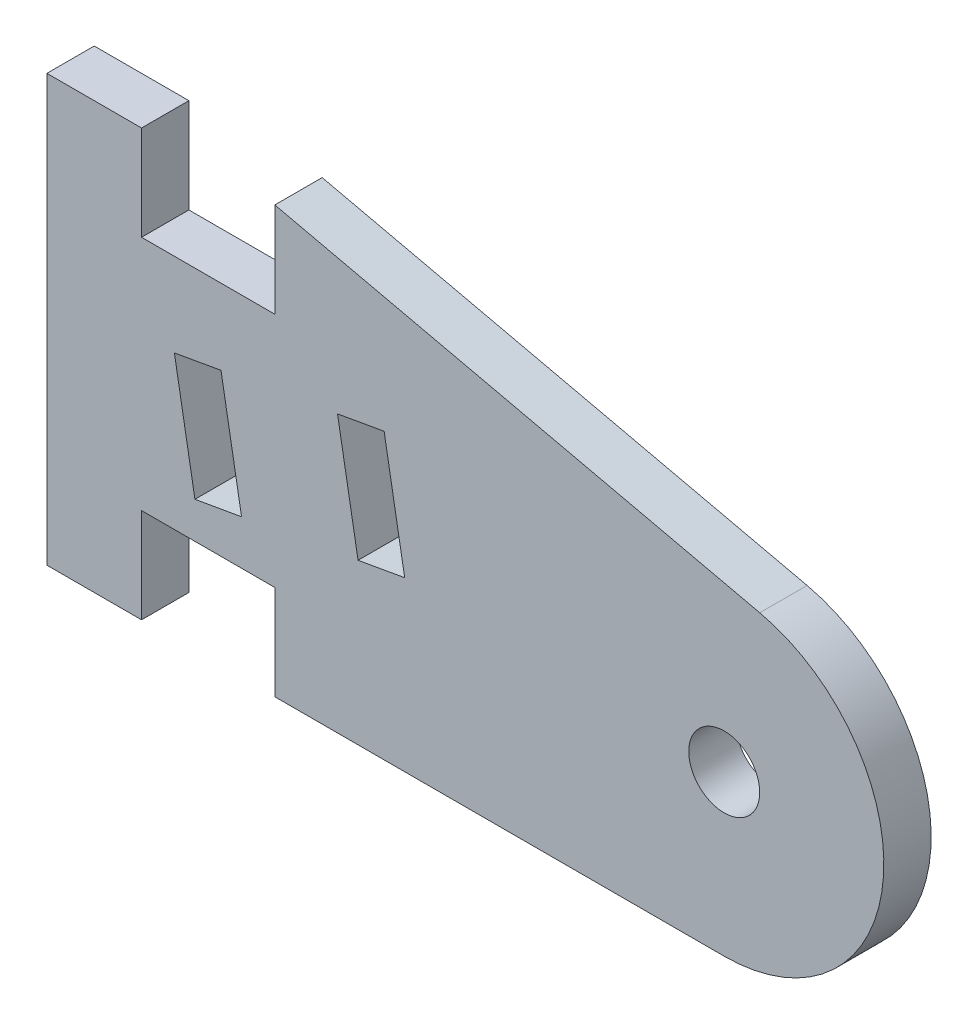
ISO-10303-21;
HEADER;
FILE_DESCRIPTION(('STEP AP214'),'2;1');
FILE_NAME('part.step','',(''),(''),'','','');
FILE_SCHEMA(('AUTOMOTIVE_DESIGN { 1 0 10303 214 1 1 1 1 }'));
ENDSEC;
DATA;
#1=APPLICATION_CONTEXT('core data for automotive mechanical design processes');
#2=APPLICATION_PROTOCOL_DEFINITION('international standard','automotive_design',2000,#1);
#3=PRODUCT_CONTEXT('',#1,'mechanical');
#4=PRODUCT('Part','Part','',(#3));
#5=PRODUCT_RELATED_PRODUCT_CATEGORY('part','',(#4));
#6=PRODUCT_DEFINITION_FORMATION('','',#4);
#7=PRODUCT_DEFINITION_CONTEXT('part definition',#1,'design');
#8=PRODUCT_DEFINITION('design','',#6,#7);
#9=PRODUCT_DEFINITION_SHAPE('','',#8);
#10=(LENGTH_UNIT() NAMED_UNIT(*) SI_UNIT(.MILLI.,.METRE.));
#11=(NAMED_UNIT(*) PLANE_ANGLE_UNIT() SI_UNIT($,.RADIAN.));
#12=(NAMED_UNIT(*) SI_UNIT($,.STERADIAN.) SOLID_ANGLE_UNIT());
#13=UNCERTAINTY_MEASURE_WITH_UNIT(LENGTH_MEASURE(1.E-05),#10,'distance_accuracy_value','');
#14=(GEOMETRIC_REPRESENTATION_CONTEXT(3) GLOBAL_UNCERTAINTY_ASSIGNED_CONTEXT((#13)) GLOBAL_UNIT_ASSIGNED_CONTEXT((#10,
#11,#12)) REPRESENTATION_CONTEXT('',''));
#15=CARTESIAN_POINT('',(0.,0.,0.));
#16=DIRECTION('',(0.,0.,1.));
#17=DIRECTION('',(1.,0.,0.));
#18=AXIS2_PLACEMENT_3D('',#15,#16,#17);
#19=CARTESIAN_POINT('',(28.6215163494173,6.74504414299814,2.));
#20=DIRECTION('',(0.,0.,1.));
#21=DIRECTION('',(1.,0.,0.));
#22=AXIS2_PLACEMENT_3D('',#19,#20,#21);
#23=PLANE('',#22);
#24=DIRECTION('',(-0.984807753012208,-0.173648177666932,0.));
#25=VECTOR('',#24,1.);
#26=CARTESIAN_POINT('',(14.2504500193325,12.02557168038,2.));
#27=LINE('',#26,#25);
#28=CARTESIAN_POINT('',(14.2504500193325,12.02557168038,2.));
#29=VERTEX_POINT('',#28);
#30=CARTESIAN_POINT('',(12.280834513308,11.6782753250461,2.));
#31=VERTEX_POINT('',#30);
#32=EDGE_CURVE('E178',#29,#31,#27,.T.);
#33=ORIENTED_EDGE('',*,*,#32,.F.);
#34=DIRECTION('',(-0.173648177666932,0.984807753012208,0.));
#35=VECTOR('',#34,1.);
#36=CARTESIAN_POINT('',(14.2504500193325,12.02557168038,2.));
#37=LINE('',#36,#35);
#38=CARTESIAN_POINT('',(15.1186909076671,7.10153291531894,2.));
#39=VERTEX_POINT('',#38);
#40=EDGE_CURVE('E170',#39,#29,#37,.T.);
#41=ORIENTED_EDGE('',*,*,#40,.F.);
#42=DIRECTION('',(0.984807753012208,0.173648177666931,0.));
#43=VECTOR('',#42,1.);
#44=CARTESIAN_POINT('',(13.1490754016427,6.75423655998508,2.));
#45=LINE('',#44,#43);
#46=CARTESIAN_POINT('',(13.1490754016427,6.75423655998508,2.));
#47=VERTEX_POINT('',#46);
#48=EDGE_CURVE('E193',#47,#39,#45,.T.);
#49=ORIENTED_EDGE('',*,*,#48,.F.);
#50=DIRECTION('',(0.173648177666932,-0.984807753012208,0.));
#51=VECTOR('',#50,1.);
#52=CARTESIAN_POINT('',(12.280834513308,11.6782753250461,2.));
#53=LINE('',#52,#51);
#54=EDGE_CURVE('E191',#31,#47,#53,.T.);
#55=ORIENTED_EDGE('',*,*,#54,.F.);
#56=EDGE_LOOP('',(#33,#41,#49,#55));
#57=FACE_BOUND('',#56,.T.);
#58=DIRECTION('',(0.,-1.,0.));
#59=VECTOR('',#58,1.);
#60=CARTESIAN_POINT('',(9.63151634941732,18.0003410835651,2.));
#61=LINE('',#60,#59);
#62=CARTESIAN_POINT('',(9.63151634941732,18.0003410835651,2.));
#63=VERTEX_POINT('',#62);
#64=CARTESIAN_POINT('',(9.63151634941733,14.0003410835651,2.));
#65=VERTEX_POINT('',#64);
#66=EDGE_CURVE('E240',#63,#65,#61,.T.);
#67=ORIENTED_EDGE('',*,*,#66,.T.);
#68=DIRECTION('',(-1.,0.,0.));
#69=VECTOR('',#68,1.);
#70=CARTESIAN_POINT('',(9.63151634941733,14.0003410835651,2.));
#71=LINE('',#70,#69);
#72=CARTESIAN_POINT('',(4.,14.0003410835651,2.));
#73=VERTEX_POINT('',#72);
#74=EDGE_CURVE('E243',#65,#73,#71,.T.);
#75=ORIENTED_EDGE('',*,*,#74,.T.);
#76=DIRECTION('',(0.,1.,0.));
#77=VECTOR('',#76,1.);
#78=CARTESIAN_POINT('',(4.,18.0003410835651,2.));
#79=LINE('',#78,#77);
#80=CARTESIAN_POINT('',(4.,18.0003410835651,2.));
#81=VERTEX_POINT('',#80);
#82=EDGE_CURVE('E246',#73,#81,#79,.T.);
#83=ORIENTED_EDGE('',*,*,#82,.T.);
#84=DIRECTION('',(-1.,0.,0.));
#85=VECTOR('',#84,1.);
#86=CARTESIAN_POINT('',(0.,18.0003410835651,2.));
#87=LINE('',#86,#85);
#88=CARTESIAN_POINT('',(0.,18.0003410835651,2.));
#89=VERTEX_POINT('',#88);
#90=EDGE_CURVE('E248',#81,#89,#87,.T.);
#91=ORIENTED_EDGE('',*,*,#90,.T.);
#92=DIRECTION('',(0.,-1.,0.));
#93=VECTOR('',#92,1.);
#94=CARTESIAN_POINT('',(0.,0.,2.));
#95=LINE('',#94,#93);
#96=CARTESIAN_POINT('',(0.,0.,2.));
#97=VERTEX_POINT('',#96);
#98=EDGE_CURVE('E250',#89,#97,#95,.T.);
#99=ORIENTED_EDGE('',*,*,#98,.T.);
#100=DIRECTION('',(1.,0.,0.));
#101=VECTOR('',#100,1.);
#102=CARTESIAN_POINT('',(0.,0.,2.));
#103=LINE('',#102,#101);
#104=CARTESIAN_POINT('',(4.,0.,2.));
#105=VERTEX_POINT('',#104);
#106=EDGE_CURVE('E252',#97,#105,#103,.T.);
#107=ORIENTED_EDGE('',*,*,#106,.T.);
#108=DIRECTION('',(0.,1.,0.));
#109=VECTOR('',#108,1.);
#110=CARTESIAN_POINT('',(4.,0.,2.));
#111=LINE('',#110,#109);
#112=CARTESIAN_POINT('',(4.,4.,2.));
#113=VERTEX_POINT('',#112);
#114=EDGE_CURVE('E254',#105,#113,#111,.T.);
#115=ORIENTED_EDGE('',*,*,#114,.T.);
#116=DIRECTION('',(1.,0.,0.));
#117=VECTOR('',#116,1.);
#118=CARTESIAN_POINT('',(9.63151634941733,4.,2.));
#119=LINE('',#118,#117);
#120=CARTESIAN_POINT('',(9.63151634941733,4.,2.));
#121=VERTEX_POINT('',#120);
#122=EDGE_CURVE('E256',#113,#121,#119,.T.);
#123=ORIENTED_EDGE('',*,*,#122,.T.);
#124=DIRECTION('',(0.,-1.,0.));
#125=VECTOR('',#124,1.);
#126=CARTESIAN_POINT('',(9.63151634941733,0.,2.));
#127=LINE('',#126,#125);
#128=CARTESIAN_POINT('',(9.63151634941733,0.,2.));
#129=VERTEX_POINT('',#128);
#130=EDGE_CURVE('E258',#121,#129,#127,.T.);
#131=ORIENTED_EDGE('',*,*,#130,.T.);
#132=DIRECTION('',(1.,0.,0.));
#133=VECTOR('',#132,1.);
#134=CARTESIAN_POINT('',(9.63151634941733,0.,2.));
#135=LINE('',#134,#133);
#136=CARTESIAN_POINT('',(28.6215163494173,0.,2.));
#137=VERTEX_POINT('',#136);
#138=EDGE_CURVE('E260',#129,#137,#135,.T.);
#139=ORIENTED_EDGE('',*,*,#138,.T.);
#140=CARTESIAN_POINT('',(28.6215163494173,6.74504414299814,2.));
#141=DIRECTION('',(0.,0.,1.));
#142=DIRECTION('',(1.,0.,0.));
#143=AXIS2_PLACEMENT_3D('',#140,#141,#142);
#144=CIRCLE('',#143,6.74504414299814);
#145=CARTESIAN_POINT('',(30.1231764912827,13.3208054912624,2.));
#146=VERTEX_POINT('',#145);
#147=EDGE_CURVE('E262',#137,#146,#144,.T.);
#148=ORIENTED_EDGE('',*,*,#147,.T.);
#149=DIRECTION('',(-0.974902640939778,0.222631625535649,0.));
#150=VECTOR('',#149,1.);
#151=CARTESIAN_POINT('',(9.63151634941732,18.0003410835651,2.));
#152=LINE('',#151,#150);
#153=EDGE_CURVE('E264',#146,#63,#152,.T.);
#154=ORIENTED_EDGE('',*,*,#153,.T.);
#155=EDGE_LOOP('',(#67,#75,#83,#91,#99,#107,#115,#123,#131,#139,#148,#154));
#156=FACE_BOUND('',#155,.T.);
#157=DIRECTION('',(0.173648177666931,-0.984807753012208,0.));
#158=VECTOR('',#157,1.);
#159=CARTESIAN_POINT('',(5.38718024222247,10.4627380813776,2.));
#160=LINE('',#159,#158);
#161=CARTESIAN_POINT('',(5.38718024222247,10.4627380813776,2.));
#162=VERTEX_POINT('',#161);
#163=CARTESIAN_POINT('',(6.25542113055713,5.53869931631654,2.));
#164=VERTEX_POINT('',#163);
#165=EDGE_CURVE('E211',#162,#164,#160,.T.);
#166=ORIENTED_EDGE('',*,*,#165,.F.);
#167=DIRECTION('',(-0.984807753012208,-0.173648177666931,0.));
#168=VECTOR('',#167,1.);
#169=CARTESIAN_POINT('',(7.35679574824689,10.8100344367115,2.));
#170=LINE('',#169,#168);
#171=CARTESIAN_POINT('',(7.35679574824689,10.8100344367115,2.));
#172=VERTEX_POINT('',#171);
#173=EDGE_CURVE('E209',#172,#162,#170,.T.);
#174=ORIENTED_EDGE('',*,*,#173,.F.);
#175=DIRECTION('',(-0.173648177666931,0.984807753012208,0.));
#176=VECTOR('',#175,1.);
#177=CARTESIAN_POINT('',(7.35679574824689,10.8100344367115,2.));
#178=LINE('',#177,#176);
#179=CARTESIAN_POINT('',(8.22503663658155,5.88599567165041,2.));
#180=VERTEX_POINT('',#179);
#181=EDGE_CURVE('E217',#180,#172,#178,.T.);
#182=ORIENTED_EDGE('',*,*,#181,.F.);
#183=DIRECTION('',(0.984807753012208,0.173648177666932,0.));
#184=VECTOR('',#183,1.);
#185=CARTESIAN_POINT('',(6.25542113055713,5.53869931631654,2.));
#186=LINE('',#185,#184);
#187=EDGE_CURVE('E214',#164,#180,#186,.T.);
#188=ORIENTED_EDGE('',*,*,#187,.F.);
#189=EDGE_LOOP('',(#166,#174,#182,#188));
#190=FACE_BOUND('',#189,.T.);
#191=CARTESIAN_POINT('',(28.6215163494173,6.74504414299814,2.));
#192=DIRECTION('',(0.,0.,1.));
#193=DIRECTION('',(1.,0.,0.));
#194=AXIS2_PLACEMENT_3D('',#191,#192,#193);
#195=CIRCLE('',#194,1.49999999999871);
#196=CARTESIAN_POINT('',(30.121516349416,6.74504414299814,2.));
#197=VERTEX_POINT('',#196);
#198=EDGE_CURVE('E199',#197,#197,#195,.T.);
#199=ORIENTED_EDGE('',*,*,#198,.F.);
#200=EDGE_LOOP('',(#199));
#201=FACE_BOUND('',#200,.T.);
#202=ADVANCED_FACE('F33',(#57,#156,#190,#201),#23,.T.);
#203=CARTESIAN_POINT('',(28.6215163494173,6.74504414299814,0.));
#204=DIRECTION('',(0.,0.,1.));
#205=DIRECTION('',(1.,0.,0.));
#206=AXIS2_PLACEMENT_3D('',#203,#204,#205);
#207=PLANE('',#206);
#208=DIRECTION('',(-0.173648177666932,0.984807753012208,0.));
#209=VECTOR('',#208,1.);
#210=CARTESIAN_POINT('',(14.2504500193325,12.02557168038,0.));
#211=LINE('',#210,#209);
#212=CARTESIAN_POINT('',(15.1186909076671,7.10153291531894,0.));
#213=VERTEX_POINT('',#212);
#214=CARTESIAN_POINT('',(14.2504500193325,12.02557168038,0.));
#215=VERTEX_POINT('',#214);
#216=EDGE_CURVE('E56',#213,#215,#211,.T.);
#217=ORIENTED_EDGE('',*,*,#216,.T.);
#218=DIRECTION('',(-0.984807753012208,-0.173648177666932,0.));
#219=VECTOR('',#218,1.);
#220=CARTESIAN_POINT('',(14.2504500193325,12.02557168038,0.));
#221=LINE('',#220,#219);
#222=CARTESIAN_POINT('',(12.280834513308,11.6782753250461,0.));
#223=VERTEX_POINT('',#222);
#224=EDGE_CURVE('E185',#215,#223,#221,.T.);
#225=ORIENTED_EDGE('',*,*,#224,.T.);
#226=DIRECTION('',(0.173648177666932,-0.984807753012208,0.));
#227=VECTOR('',#226,1.);
#228=CARTESIAN_POINT('',(12.280834513308,11.6782753250461,0.));
#229=LINE('',#228,#227);
#230=CARTESIAN_POINT('',(13.1490754016427,6.75423655998508,0.));
#231=VERTEX_POINT('',#230);
#232=EDGE_CURVE('E201',#223,#231,#229,.T.);
#233=ORIENTED_EDGE('',*,*,#232,.T.);
#234=DIRECTION('',(0.984807753012208,0.173648177666931,0.));
#235=VECTOR('',#234,1.);
#236=CARTESIAN_POINT('',(13.1490754016427,6.75423655998508,0.));
#237=LINE('',#236,#235);
#238=EDGE_CURVE('E179',#231,#213,#237,.T.);
#239=ORIENTED_EDGE('',*,*,#238,.T.);
#240=EDGE_LOOP('',(#217,#225,#233,#239));
#241=FACE_BOUND('',#240,.T.);
#242=DIRECTION('',(0.,-1.,0.));
#243=VECTOR('',#242,1.);
#244=CARTESIAN_POINT('',(9.63151634941732,18.0003410835651,0.));
#245=LINE('',#244,#243);
#246=CARTESIAN_POINT('',(9.63151634941732,18.0003410835651,0.));
#247=VERTEX_POINT('',#246);
#248=CARTESIAN_POINT('',(9.63151634941733,14.0003410835651,0.));
#249=VERTEX_POINT('',#248);
#250=EDGE_CURVE('E239',#247,#249,#245,.T.);
#251=ORIENTED_EDGE('',*,*,#250,.F.);
#252=DIRECTION('',(-0.974902640939778,0.222631625535649,0.));
#253=VECTOR('',#252,1.);
#254=CARTESIAN_POINT('',(9.63151634941732,18.0003410835651,0.));
#255=LINE('',#254,#253);
#256=CARTESIAN_POINT('',(30.1231764912827,13.3208054912624,0.));
#257=VERTEX_POINT('',#256);
#258=EDGE_CURVE('E244',#257,#247,#255,.T.);
#259=ORIENTED_EDGE('',*,*,#258,.F.);
#260=CARTESIAN_POINT('',(28.6215163494173,6.74504414299814,0.));
#261=DIRECTION('',(0.,0.,1.));
#262=DIRECTION('',(1.,0.,0.));
#263=AXIS2_PLACEMENT_3D('',#260,#261,#262);
#264=CIRCLE('',#263,6.74504414299814);
#265=CARTESIAN_POINT('',(28.6215163494173,0.,0.));
#266=VERTEX_POINT('',#265);
#267=EDGE_CURVE('E287',#266,#257,#264,.T.);
#268=ORIENTED_EDGE('',*,*,#267,.F.);
#269=DIRECTION('',(1.,0.,0.));
#270=VECTOR('',#269,1.);
#271=CARTESIAN_POINT('',(9.63151634941733,0.,0.));
#272=LINE('',#271,#270);
#273=CARTESIAN_POINT('',(9.63151634941733,0.,0.));
#274=VERTEX_POINT('',#273);
#275=EDGE_CURVE('E285',#274,#266,#272,.T.);
#276=ORIENTED_EDGE('',*,*,#275,.F.);
#277=DIRECTION('',(0.,-1.,0.));
#278=VECTOR('',#277,1.);
#279=CARTESIAN_POINT('',(9.63151634941733,0.,0.));
#280=LINE('',#279,#278);
#281=CARTESIAN_POINT('',(9.63151634941733,4.,0.));
#282=VERTEX_POINT('',#281);
#283=EDGE_CURVE('E283',#282,#274,#280,.T.);
#284=ORIENTED_EDGE('',*,*,#283,.F.);
#285=DIRECTION('',(1.,0.,0.));
#286=VECTOR('',#285,1.);
#287=CARTESIAN_POINT('',(9.63151634941733,4.,0.));
#288=LINE('',#287,#286);
#289=CARTESIAN_POINT('',(4.,4.,0.));
#290=VERTEX_POINT('',#289);
#291=EDGE_CURVE('E281',#290,#282,#288,.T.);
#292=ORIENTED_EDGE('',*,*,#291,.F.);
#293=DIRECTION('',(0.,1.,0.));
#294=VECTOR('',#293,1.);
#295=CARTESIAN_POINT('',(4.,0.,0.));
#296=LINE('',#295,#294);
#297=CARTESIAN_POINT('',(4.,0.,0.));
#298=VERTEX_POINT('',#297);
#299=EDGE_CURVE('E279',#298,#290,#296,.T.);
#300=ORIENTED_EDGE('',*,*,#299,.F.);
#301=DIRECTION('',(1.,0.,0.));
#302=VECTOR('',#301,1.);
#303=CARTESIAN_POINT('',(0.,0.,0.));
#304=LINE('',#303,#302);
#305=CARTESIAN_POINT('',(0.,0.,0.));
#306=VERTEX_POINT('',#305);
#307=EDGE_CURVE('E277',#306,#298,#304,.T.);
#308=ORIENTED_EDGE('',*,*,#307,.F.);
#309=DIRECTION('',(0.,-1.,0.));
#310=VECTOR('',#309,1.);
#311=CARTESIAN_POINT('',(0.,0.,0.));
#312=LINE('',#311,#310);
#313=CARTESIAN_POINT('',(0.,18.0003410835651,0.));
#314=VERTEX_POINT('',#313);
#315=EDGE_CURVE('E275',#314,#306,#312,.T.);
#316=ORIENTED_EDGE('',*,*,#315,.F.);
#317=DIRECTION('',(-1.,0.,0.));
#318=VECTOR('',#317,1.);
#319=CARTESIAN_POINT('',(0.,18.0003410835651,0.));
#320=LINE('',#319,#318);
#321=CARTESIAN_POINT('',(4.,18.0003410835651,0.));
#322=VERTEX_POINT('',#321);
#323=EDGE_CURVE('E273',#322,#314,#320,.T.);
#324=ORIENTED_EDGE('',*,*,#323,.F.);
#325=DIRECTION('',(0.,1.,0.));
#326=VECTOR('',#325,1.);
#327=CARTESIAN_POINT('',(4.,18.0003410835651,0.));
#328=LINE('',#327,#326);
#329=CARTESIAN_POINT('',(4.,14.0003410835651,0.));
#330=VERTEX_POINT('',#329);
#331=EDGE_CURVE('E271',#330,#322,#328,.T.);
#332=ORIENTED_EDGE('',*,*,#331,.F.);
#333=DIRECTION('',(-1.,0.,0.));
#334=VECTOR('',#333,1.);
#335=CARTESIAN_POINT('',(9.63151634941733,14.0003410835651,0.));
#336=LINE('',#335,#334);
#337=EDGE_CURVE('E269',#249,#330,#336,.T.);
#338=ORIENTED_EDGE('',*,*,#337,.F.);
#339=EDGE_LOOP('',(#251,#259,#268,#276,#284,#292,#300,#308,#316,#324,#332,#338));
#340=FACE_BOUND('',#339,.T.);
#341=DIRECTION('',(-0.984807753012208,-0.173648177666931,0.));
#342=VECTOR('',#341,1.);
#343=CARTESIAN_POINT('',(7.35679574824689,10.8100344367115,0.));
#344=LINE('',#343,#342);
#345=CARTESIAN_POINT('',(7.35679574824689,10.8100344367115,0.));
#346=VERTEX_POINT('',#345);
#347=CARTESIAN_POINT('',(5.38718024222247,10.4627380813776,0.));
#348=VERTEX_POINT('',#347);
#349=EDGE_CURVE('E186',#346,#348,#344,.T.);
#350=ORIENTED_EDGE('',*,*,#349,.T.);
#351=DIRECTION('',(0.173648177666931,-0.984807753012208,0.));
#352=VECTOR('',#351,1.);
#353=CARTESIAN_POINT('',(5.38718024222247,10.4627380813776,0.));
#354=LINE('',#353,#352);
#355=CARTESIAN_POINT('',(6.25542113055713,5.53869931631654,0.));
#356=VERTEX_POINT('',#355);
#357=EDGE_CURVE('E222',#348,#356,#354,.T.);
#358=ORIENTED_EDGE('',*,*,#357,.T.);
#359=DIRECTION('',(0.984807753012208,0.173648177666932,0.));
#360=VECTOR('',#359,1.);
#361=CARTESIAN_POINT('',(6.25542113055713,5.53869931631654,0.));
#362=LINE('',#361,#360);
#363=CARTESIAN_POINT('',(8.22503663658155,5.88599567165041,0.));
#364=VERTEX_POINT('',#363);
#365=EDGE_CURVE('E225',#356,#364,#362,.T.);
#366=ORIENTED_EDGE('',*,*,#365,.T.);
#367=DIRECTION('',(-0.173648177666931,0.984807753012208,0.));
#368=VECTOR('',#367,1.);
#369=CARTESIAN_POINT('',(7.35679574824689,10.8100344367115,0.));
#370=LINE('',#369,#368);
#371=EDGE_CURVE('E212',#364,#346,#370,.T.);
#372=ORIENTED_EDGE('',*,*,#371,.T.);
#373=EDGE_LOOP('',(#350,#358,#366,#372));
#374=FACE_BOUND('',#373,.T.);
#375=CARTESIAN_POINT('',(28.6215163494173,6.74504414299814,0.));
#376=DIRECTION('',(0.,0.,1.));
#377=DIRECTION('',(1.,0.,0.));
#378=AXIS2_PLACEMENT_3D('',#375,#376,#377);
#379=CIRCLE('',#378,1.49999999999871);
#380=CARTESIAN_POINT('',(30.121516349416,6.74504414299814,0.));
#381=VERTEX_POINT('',#380);
#382=EDGE_CURVE('E581',#381,#381,#379,.T.);
#383=ORIENTED_EDGE('',*,*,#382,.T.);
#384=EDGE_LOOP('',(#383));
#385=FACE_BOUND('',#384,.T.);
#386=ADVANCED_FACE('F329',(#241,#340,#374,#385),#207,.F.);
#387=CARTESIAN_POINT('',(9.63151634941732,18.0003410835651,2.));
#388=DIRECTION('',(1.,0.,0.));
#389=DIRECTION('',(0.,1.,0.));
#390=AXIS2_PLACEMENT_3D('',#387,#388,#389);
#391=PLANE('',#390);
#392=ORIENTED_EDGE('',*,*,#250,.T.);
#393=DIRECTION('',(0.,0.,-1.));
#394=VECTOR('',#393,1.);
#395=CARTESIAN_POINT('',(9.63151634941733,14.0003410835651,2.));
#396=LINE('',#395,#394);
#397=EDGE_CURVE('E11',#65,#249,#396,.T.);
#398=ORIENTED_EDGE('',*,*,#397,.F.);
#399=ORIENTED_EDGE('',*,*,#66,.F.);
#400=DIRECTION('',(0.,0.,-1.));
#401=VECTOR('',#400,1.);
#402=CARTESIAN_POINT('',(9.63151634941732,18.0003410835651,2.));
#403=LINE('',#402,#401);
#404=EDGE_CURVE('E266',#63,#247,#403,.T.);
#405=ORIENTED_EDGE('',*,*,#404,.T.);
#406=EDGE_LOOP('',(#392,#398,#399,#405));
#407=FACE_BOUND('',#406,.T.);
#408=ADVANCED_FACE('F35',(#407),#391,.F.);
#409=CARTESIAN_POINT('',(9.63151634941733,14.0003410835651,2.));
#410=DIRECTION('',(0.,-1.,0.));
#411=DIRECTION('',(1.,0.,0.));
#412=AXIS2_PLACEMENT_3D('',#409,#410,#411);
#413=PLANE('',#412);
#414=ORIENTED_EDGE('',*,*,#337,.T.);
#415=DIRECTION('',(0.,0.,-1.));
#416=VECTOR('',#415,1.);
#417=CARTESIAN_POINT('',(4.,14.0003410835651,2.));
#418=LINE('',#417,#416);
#419=EDGE_CURVE('E41',#73,#330,#418,.T.);
#420=ORIENTED_EDGE('',*,*,#419,.F.);
#421=ORIENTED_EDGE('',*,*,#74,.F.);
#422=ORIENTED_EDGE('',*,*,#397,.T.);
#423=EDGE_LOOP('',(#414,#420,#421,#422));
#424=FACE_BOUND('',#423,.T.);
#425=ADVANCED_FACE('F346',(#424),#413,.F.);
#426=CARTESIAN_POINT('',(4.,18.0003410835651,2.));
#427=DIRECTION('',(-1.,0.,0.));
#428=DIRECTION('',(0.,-1.,0.));
#429=AXIS2_PLACEMENT_3D('',#426,#427,#428);
#430=PLANE('',#429);
#431=ORIENTED_EDGE('',*,*,#331,.T.);
#432=DIRECTION('',(0.,0.,-1.));
#433=VECTOR('',#432,1.);
#434=CARTESIAN_POINT('',(4.,18.0003410835651,2.));
#435=LINE('',#434,#433);
#436=EDGE_CURVE('E316',#81,#322,#435,.T.);
#437=ORIENTED_EDGE('',*,*,#436,.F.);
#438=ORIENTED_EDGE('',*,*,#82,.F.);
#439=ORIENTED_EDGE('',*,*,#419,.T.);
#440=EDGE_LOOP('',(#431,#437,#438,#439));
#441=FACE_BOUND('',#440,.T.);
#442=ADVANCED_FACE('F323',(#441),#430,.F.);
#443=CARTESIAN_POINT('',(0.,18.0003410835651,2.));
#444=DIRECTION('',(0.,-1.,0.));
#445=DIRECTION('',(0.,0.,-1.));
#446=AXIS2_PLACEMENT_3D('',#443,#444,#445);
#447=PLANE('',#446);
#448=ORIENTED_EDGE('',*,*,#323,.T.);
#449=DIRECTION('',(0.,0.,-1.));
#450=VECTOR('',#449,1.);
#451=CARTESIAN_POINT('',(0.,18.0003410835651,2.));
#452=LINE('',#451,#450);
#453=EDGE_CURVE('E313',#89,#314,#452,.T.);
#454=ORIENTED_EDGE('',*,*,#453,.F.);
#455=ORIENTED_EDGE('',*,*,#90,.F.);
#456=ORIENTED_EDGE('',*,*,#436,.T.);
#457=EDGE_LOOP('',(#448,#454,#455,#456));
#458=FACE_BOUND('',#457,.T.);
#459=ADVANCED_FACE('F335',(#458),#447,.F.);
#460=CARTESIAN_POINT('',(0.,0.,2.));
#461=DIRECTION('',(1.,0.,0.));
#462=DIRECTION('',(0.,1.,0.));
#463=AXIS2_PLACEMENT_3D('',#460,#461,#462);
#464=PLANE('',#463);
#465=ORIENTED_EDGE('',*,*,#315,.T.);
#466=DIRECTION('',(0.,0.,-1.));
#467=VECTOR('',#466,1.);
#468=CARTESIAN_POINT('',(0.,0.,2.));
#469=LINE('',#468,#467);
#470=EDGE_CURVE('E310',#97,#306,#469,.T.);
#471=ORIENTED_EDGE('',*,*,#470,.F.);
#472=ORIENTED_EDGE('',*,*,#98,.F.);
#473=ORIENTED_EDGE('',*,*,#453,.T.);
#474=EDGE_LOOP('',(#465,#471,#472,#473));
#475=FACE_BOUND('',#474,.T.);
#476=ADVANCED_FACE('F339',(#475),#464,.F.);
#477=CARTESIAN_POINT('',(0.,0.,2.));
#478=DIRECTION('',(0.,1.,0.));
#479=DIRECTION('',(0.,0.,1.));
#480=AXIS2_PLACEMENT_3D('',#477,#478,#479);
#481=PLANE('',#480);
#482=ORIENTED_EDGE('',*,*,#307,.T.);
#483=DIRECTION('',(0.,0.,-1.));
#484=VECTOR('',#483,1.);
#485=CARTESIAN_POINT('',(4.,0.,2.));
#486=LINE('',#485,#484);
#487=EDGE_CURVE('E307',#105,#298,#486,.T.);
#488=ORIENTED_EDGE('',*,*,#487,.F.);
#489=ORIENTED_EDGE('',*,*,#106,.F.);
#490=ORIENTED_EDGE('',*,*,#470,.T.);
#491=EDGE_LOOP('',(#482,#488,#489,#490));
#492=FACE_BOUND('',#491,.T.);
#493=ADVANCED_FACE('F379',(#492),#481,.F.);
#494=CARTESIAN_POINT('',(4.,0.,2.));
#495=DIRECTION('',(-1.,0.,0.));
#496=DIRECTION('',(0.,0.,1.));
#497=AXIS2_PLACEMENT_3D('',#494,#495,#496);
#498=PLANE('',#497);
#499=ORIENTED_EDGE('',*,*,#299,.T.);
#500=DIRECTION('',(0.,0.,-1.));
#501=VECTOR('',#500,1.);
#502=CARTESIAN_POINT('',(4.,4.,2.));
#503=LINE('',#502,#501);
#504=EDGE_CURVE('E304',#113,#290,#503,.T.);
#505=ORIENTED_EDGE('',*,*,#504,.F.);
#506=ORIENTED_EDGE('',*,*,#114,.F.);
#507=ORIENTED_EDGE('',*,*,#487,.T.);
#508=EDGE_LOOP('',(#499,#505,#506,#507));
#509=FACE_BOUND('',#508,.T.);
#510=ADVANCED_FACE('F377',(#509),#498,.F.);
#511=CARTESIAN_POINT('',(9.63151634941733,4.,2.));
#512=DIRECTION('',(0.,1.,0.));
#513=DIRECTION('',(-1.,0.,0.));
#514=AXIS2_PLACEMENT_3D('',#511,#512,#513);
#515=PLANE('',#514);
#516=ORIENTED_EDGE('',*,*,#291,.T.);
#517=DIRECTION('',(0.,0.,-1.));
#518=VECTOR('',#517,1.);
#519=CARTESIAN_POINT('',(9.63151634941733,4.,2.));
#520=LINE('',#519,#518);
#521=EDGE_CURVE('E301',#121,#282,#520,.T.);
#522=ORIENTED_EDGE('',*,*,#521,.F.);
#523=ORIENTED_EDGE('',*,*,#122,.F.);
#524=ORIENTED_EDGE('',*,*,#504,.T.);
#525=EDGE_LOOP('',(#516,#522,#523,#524));
#526=FACE_BOUND('',#525,.T.);
#527=ADVANCED_FACE('F373',(#526),#515,.F.);
#528=CARTESIAN_POINT('',(9.63151634941733,0.,2.));
#529=DIRECTION('',(1.,0.,0.));
#530=DIRECTION('',(0.,0.,-1.));
#531=AXIS2_PLACEMENT_3D('',#528,#529,#530);
#532=PLANE('',#531);
#533=ORIENTED_EDGE('',*,*,#283,.T.);
#534=DIRECTION('',(0.,0.,-1.));
#535=VECTOR('',#534,1.);
#536=CARTESIAN_POINT('',(9.63151634941733,0.,2.));
#537=LINE('',#536,#535);
#538=EDGE_CURVE('E298',#129,#274,#537,.T.);
#539=ORIENTED_EDGE('',*,*,#538,.F.);
#540=ORIENTED_EDGE('',*,*,#130,.F.);
#541=ORIENTED_EDGE('',*,*,#521,.T.);
#542=EDGE_LOOP('',(#533,#539,#540,#541));
#543=FACE_BOUND('',#542,.T.);
#544=ADVANCED_FACE('F368',(#543),#532,.F.);
#545=CARTESIAN_POINT('',(9.63151634941733,0.,2.));
#546=DIRECTION('',(0.,1.,0.));
#547=DIRECTION('',(0.,0.,1.));
#548=AXIS2_PLACEMENT_3D('',#545,#546,#547);
#549=PLANE('',#548);
#550=ORIENTED_EDGE('',*,*,#275,.T.);
#551=DIRECTION('',(0.,0.,-1.));
#552=VECTOR('',#551,1.);
#553=CARTESIAN_POINT('',(28.6215163494173,0.,2.));
#554=LINE('',#553,#552);
#555=EDGE_CURVE('E295',#137,#266,#554,.T.);
#556=ORIENTED_EDGE('',*,*,#555,.F.);
#557=ORIENTED_EDGE('',*,*,#138,.F.);
#558=ORIENTED_EDGE('',*,*,#538,.T.);
#559=EDGE_LOOP('',(#550,#556,#557,#558));
#560=FACE_BOUND('',#559,.T.);
#561=ADVANCED_FACE('F362',(#560),#549,.F.);
#562=CARTESIAN_POINT('',(28.6215163494173,6.74504414299814,2.));
#563=DIRECTION('',(0.,0.,-1.));
#564=DIRECTION('',(-1.,0.,0.));
#565=AXIS2_PLACEMENT_3D('',#562,#563,#564);
#566=CYLINDRICAL_SURFACE('',#565,6.74504414299814);
#567=ORIENTED_EDGE('',*,*,#267,.T.);
#568=DIRECTION('',(0.,0.,-1.));
#569=VECTOR('',#568,1.);
#570=CARTESIAN_POINT('',(30.1231764912827,13.3208054912624,2.));
#571=LINE('',#570,#569);
#572=EDGE_CURVE('E292',#146,#257,#571,.T.);
#573=ORIENTED_EDGE('',*,*,#572,.F.);
#574=ORIENTED_EDGE('',*,*,#147,.F.);
#575=ORIENTED_EDGE('',*,*,#555,.T.);
#576=EDGE_LOOP('',(#567,#573,#574,#575));
#577=FACE_BOUND('',#576,.T.);
#578=ADVANCED_FACE('F358',(#577),#566,.T.);
#579=CARTESIAN_POINT('',(9.63151634941732,18.0003410835651,2.));
#580=DIRECTION('',(-0.222631625535649,-0.974902640939778,0.));
#581=DIRECTION('',(0.974902640939779,-0.222631625535649,0.));
#582=AXIS2_PLACEMENT_3D('',#579,#580,#581);
#583=PLANE('',#582);
#584=ORIENTED_EDGE('',*,*,#258,.T.);
#585=ORIENTED_EDGE('',*,*,#404,.F.);
#586=ORIENTED_EDGE('',*,*,#153,.F.);
#587=ORIENTED_EDGE('',*,*,#572,.T.);
#588=EDGE_LOOP('',(#584,#585,#586,#587));
#589=FACE_BOUND('',#588,.T.);
#590=ADVANCED_FACE('F353',(#589),#583,.F.);
#591=CARTESIAN_POINT('',(7.35679574824689,10.8100344367115,2.));
#592=DIRECTION('',(0.173648177666931,-0.984807753012208,0.));
#593=DIRECTION('',(0.984807753012208,0.173648177666931,0.));
#594=AXIS2_PLACEMENT_3D('',#591,#592,#593);
#595=PLANE('',#594);
#596=ORIENTED_EDGE('',*,*,#349,.F.);
#597=DIRECTION('',(0.,0.,-1.));
#598=VECTOR('',#597,1.);
#599=CARTESIAN_POINT('',(7.35679574824689,10.8100344367115,2.));
#600=LINE('',#599,#598);
#601=EDGE_CURVE('E219',#172,#346,#600,.T.);
#602=ORIENTED_EDGE('',*,*,#601,.F.);
#603=ORIENTED_EDGE('',*,*,#173,.T.);
#604=DIRECTION('',(0.,0.,-1.));
#605=VECTOR('',#604,1.);
#606=CARTESIAN_POINT('',(5.38718024222247,10.4627380813776,2.));
#607=LINE('',#606,#605);
#608=EDGE_CURVE('E236',#162,#348,#607,.T.);
#609=ORIENTED_EDGE('',*,*,#608,.T.);
#610=EDGE_LOOP('',(#596,#602,#603,#609));
#611=FACE_BOUND('',#610,.T.);
#612=ADVANCED_FACE('F396',(#611),#595,.T.);
#613=CARTESIAN_POINT('',(5.38718024222247,10.4627380813776,2.));
#614=DIRECTION('',(0.984807753012208,0.173648177666931,0.));
#615=DIRECTION('',(-0.173648177666931,0.984807753012208,0.));
#616=AXIS2_PLACEMENT_3D('',#613,#614,#615);
#617=PLANE('',#616);
#618=ORIENTED_EDGE('',*,*,#357,.F.);
#619=ORIENTED_EDGE('',*,*,#608,.F.);
#620=ORIENTED_EDGE('',*,*,#165,.T.);
#621=DIRECTION('',(0.,0.,-1.));
#622=VECTOR('',#621,1.);
#623=CARTESIAN_POINT('',(6.25542113055713,5.53869931631654,2.));
#624=LINE('',#623,#622);
#625=EDGE_CURVE('E234',#164,#356,#624,.T.);
#626=ORIENTED_EDGE('',*,*,#625,.T.);
#627=EDGE_LOOP('',(#618,#619,#620,#626));
#628=FACE_BOUND('',#627,.T.);
#629=ADVANCED_FACE('F434',(#628),#617,.T.);
#630=CARTESIAN_POINT('',(6.25542113055713,5.53869931631654,2.));
#631=DIRECTION('',(-0.173648177666932,0.984807753012208,0.));
#632=DIRECTION('',(-0.984807753012208,-0.173648177666932,0.));
#633=AXIS2_PLACEMENT_3D('',#630,#631,#632);
#634=PLANE('',#633);
#635=ORIENTED_EDGE('',*,*,#365,.F.);
#636=ORIENTED_EDGE('',*,*,#625,.F.);
#637=ORIENTED_EDGE('',*,*,#187,.T.);
#638=DIRECTION('',(0.,0.,-1.));
#639=VECTOR('',#638,1.);
#640=CARTESIAN_POINT('',(8.22503663658155,5.88599567165041,2.));
#641=LINE('',#640,#639);
#642=EDGE_CURVE('E232',#180,#364,#641,.T.);
#643=ORIENTED_EDGE('',*,*,#642,.T.);
#644=EDGE_LOOP('',(#635,#636,#637,#643));
#645=FACE_BOUND('',#644,.T.);
#646=ADVANCED_FACE('F441',(#645),#634,.T.);
#647=CARTESIAN_POINT('',(7.35679574824689,10.8100344367115,2.));
#648=DIRECTION('',(-0.984807753012208,-0.173648177666931,0.));
#649=DIRECTION('',(0.173648177666931,-0.984807753012208,0.));
#650=AXIS2_PLACEMENT_3D('',#647,#648,#649);
#651=PLANE('',#650);
#652=ORIENTED_EDGE('',*,*,#371,.F.);
#653=ORIENTED_EDGE('',*,*,#642,.F.);
#654=ORIENTED_EDGE('',*,*,#181,.T.);
#655=ORIENTED_EDGE('',*,*,#601,.T.);
#656=EDGE_LOOP('',(#652,#653,#654,#655));
#657=FACE_BOUND('',#656,.T.);
#658=ADVANCED_FACE('F448',(#657),#651,.T.);
#659=CARTESIAN_POINT('',(14.2504500193325,12.02557168038,2.));
#660=DIRECTION('',(-0.984807753012208,-0.173648177666932,0.));
#661=DIRECTION('',(0.173648177666932,-0.984807753012208,0.));
#662=AXIS2_PLACEMENT_3D('',#659,#660,#661);
#663=PLANE('',#662);
#664=ORIENTED_EDGE('',*,*,#216,.F.);
#665=DIRECTION('',(0.,0.,-1.));
#666=VECTOR('',#665,1.);
#667=CARTESIAN_POINT('',(15.1186909076671,7.10153291531894,2.));
#668=LINE('',#667,#666);
#669=EDGE_CURVE('E174',#39,#213,#668,.T.);
#670=ORIENTED_EDGE('',*,*,#669,.F.);
#671=ORIENTED_EDGE('',*,*,#40,.T.);
#672=DIRECTION('',(0.,0.,-1.));
#673=VECTOR('',#672,1.);
#674=CARTESIAN_POINT('',(14.2504500193325,12.02557168038,2.));
#675=LINE('',#674,#673);
#676=EDGE_CURVE('E173',#29,#215,#675,.T.);
#677=ORIENTED_EDGE('',*,*,#676,.T.);
#678=EDGE_LOOP('',(#664,#670,#671,#677));
#679=FACE_BOUND('',#678,.T.);
#680=ADVANCED_FACE('F172',(#679),#663,.T.);
#681=CARTESIAN_POINT('',(14.2504500193325,12.02557168038,2.));
#682=DIRECTION('',(0.173648177666932,-0.984807753012208,0.));
#683=DIRECTION('',(0.984807753012208,0.173648177666932,0.));
#684=AXIS2_PLACEMENT_3D('',#681,#682,#683);
#685=PLANE('',#684);
#686=ORIENTED_EDGE('',*,*,#224,.F.);
#687=ORIENTED_EDGE('',*,*,#676,.F.);
#688=ORIENTED_EDGE('',*,*,#32,.T.);
#689=DIRECTION('',(0.,0.,-1.));
#690=VECTOR('',#689,1.);
#691=CARTESIAN_POINT('',(12.280834513308,11.6782753250461,2.));
#692=LINE('',#691,#690);
#693=EDGE_CURVE('E187',#31,#223,#692,.T.);
#694=ORIENTED_EDGE('',*,*,#693,.T.);
#695=EDGE_LOOP('',(#686,#687,#688,#694));
#696=FACE_BOUND('',#695,.T.);
#697=ADVANCED_FACE('F182',(#696),#685,.T.);
#698=CARTESIAN_POINT('',(12.280834513308,11.6782753250461,2.));
#699=DIRECTION('',(0.984807753012208,0.173648177666932,0.));
#700=DIRECTION('',(-0.173648177666932,0.984807753012208,0.));
#701=AXIS2_PLACEMENT_3D('',#698,#699,#700);
#702=PLANE('',#701);
#703=ORIENTED_EDGE('',*,*,#232,.F.);
#704=ORIENTED_EDGE('',*,*,#693,.F.);
#705=ORIENTED_EDGE('',*,*,#54,.T.);
#706=DIRECTION('',(0.,0.,-1.));
#707=VECTOR('',#706,1.);
#708=CARTESIAN_POINT('',(13.1490754016427,6.75423655998508,2.));
#709=LINE('',#708,#707);
#710=EDGE_CURVE('E48',#47,#231,#709,.T.);
#711=ORIENTED_EDGE('',*,*,#710,.T.);
#712=EDGE_LOOP('',(#703,#704,#705,#711));
#713=FACE_BOUND('',#712,.T.);
#714=ADVANCED_FACE('F469',(#713),#702,.T.);
#715=CARTESIAN_POINT('',(13.1490754016427,6.75423655998508,2.));
#716=DIRECTION('',(-0.173648177666931,0.984807753012208,0.));
#717=DIRECTION('',(-0.984807753012208,-0.173648177666931,0.));
#718=AXIS2_PLACEMENT_3D('',#715,#716,#717);
#719=PLANE('',#718);
#720=ORIENTED_EDGE('',*,*,#238,.F.);
#721=ORIENTED_EDGE('',*,*,#710,.F.);
#722=ORIENTED_EDGE('',*,*,#48,.T.);
#723=ORIENTED_EDGE('',*,*,#669,.T.);
#724=EDGE_LOOP('',(#720,#721,#722,#723));
#725=FACE_BOUND('',#724,.T.);
#726=ADVANCED_FACE('F476',(#725),#719,.T.);
#727=CARTESIAN_POINT('',(28.6215163494173,6.74504414299814,2.));
#728=DIRECTION('',(0.,0.,-1.));
#729=DIRECTION('',(-1.,0.,0.));
#730=AXIS2_PLACEMENT_3D('',#727,#728,#729);
#731=CYLINDRICAL_SURFACE('',#730,1.49999999999871);
#732=ORIENTED_EDGE('',*,*,#198,.T.);
#733=EDGE_LOOP('',(#732));
#734=FACE_BOUND('',#733,.T.);
#735=ORIENTED_EDGE('',*,*,#382,.F.);
#736=EDGE_LOOP('',(#735));
#737=FACE_BOUND('',#736,.T.);
#738=ADVANCED_FACE('F484',(#734,#737),#731,.F.);
#739=CLOSED_SHELL('',(#202,#386,#408,#425,#442,#459,#476,#493,#510,#527,#544,#561,#578,#590,
#612,#629,#646,#658,#680,#697,#714,#726,#738));
#740=MANIFOLD_SOLID_BREP('B2',#739);
#741=ADVANCED_BREP_SHAPE_REPRESENTATION('',(#18,#740),#14);
#742=SHAPE_DEFINITION_REPRESENTATION(#9,#741);
ENDSEC;
END-ISO-10303-21;
